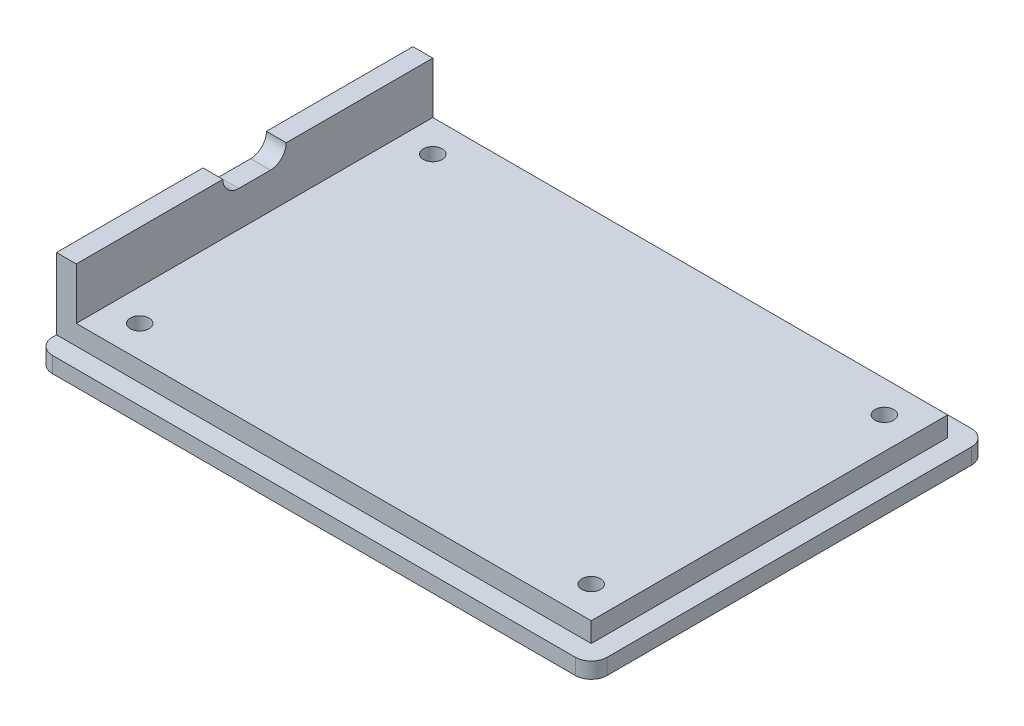
ISO-10303-21;
HEADER;
FILE_DESCRIPTION(('STEP AP214'),'2;1');
FILE_NAME('part.step','',(''),(''),'','','');
FILE_SCHEMA(('AUTOMOTIVE_DESIGN { 1 0 10303 214 1 1 1 1 }'));
ENDSEC;
DATA;
#1=APPLICATION_CONTEXT('core data for automotive mechanical design processes');
#2=APPLICATION_PROTOCOL_DEFINITION('international standard','automotive_design',2000,#1);
#3=PRODUCT_CONTEXT('',#1,'mechanical');
#4=PRODUCT('Part','Part','',(#3));
#5=PRODUCT_RELATED_PRODUCT_CATEGORY('part','',(#4));
#6=PRODUCT_DEFINITION_FORMATION('','',#4);
#7=PRODUCT_DEFINITION_CONTEXT('part definition',#1,'design');
#8=PRODUCT_DEFINITION('design','',#6,#7);
#9=PRODUCT_DEFINITION_SHAPE('','',#8);
#10=(LENGTH_UNIT() NAMED_UNIT(*) SI_UNIT(.MILLI.,.METRE.));
#11=(NAMED_UNIT(*) PLANE_ANGLE_UNIT() SI_UNIT($,.RADIAN.));
#12=(NAMED_UNIT(*) SI_UNIT($,.STERADIAN.) SOLID_ANGLE_UNIT());
#13=UNCERTAINTY_MEASURE_WITH_UNIT(LENGTH_MEASURE(1.E-05),#10,'distance_accuracy_value','');
#14=(GEOMETRIC_REPRESENTATION_CONTEXT(3) GLOBAL_UNCERTAINTY_ASSIGNED_CONTEXT((#13)) GLOBAL_UNIT_ASSIGNED_CONTEXT((#10,
#11,#12)) REPRESENTATION_CONTEXT('',''));
#15=CARTESIAN_POINT('',(0.,0.,0.));
#16=DIRECTION('',(0.,0.,1.));
#17=DIRECTION('',(1.,0.,0.));
#18=AXIS2_PLACEMENT_3D('',#15,#16,#17);
#19=CARTESIAN_POINT('',(-36.195,-7.493,-23.495));
#20=DIRECTION('',(0.,1.,0.));
#21=DIRECTION('',(0.,0.,1.));
#22=AXIS2_PLACEMENT_3D('',#19,#20,#21);
#23=CYLINDRICAL_SURFACE('',#22,1.5);
#24=CARTESIAN_POINT('',(-36.195,5.715,-23.495));
#25=DIRECTION('',(0.,1.,0.));
#26=DIRECTION('',(0.,0.,1.));
#27=AXIS2_PLACEMENT_3D('',#24,#25,#26);
#28=CIRCLE('',#27,1.5);
#29=CARTESIAN_POINT('',(-36.195,5.715,-21.995));
#30=VERTEX_POINT('',#29);
#31=EDGE_CURVE('E199',#30,#30,#28,.T.);
#32=ORIENTED_EDGE('',*,*,#31,.T.);
#33=EDGE_LOOP('',(#32));
#34=FACE_BOUND('',#33,.T.);
#35=CARTESIAN_POINT('',(-36.195,3.175,-23.495));
#36=DIRECTION('',(0.,-1.,0.));
#37=DIRECTION('',(0.,0.,-1.));
#38=AXIS2_PLACEMENT_3D('',#35,#36,#37);
#39=CIRCLE('',#38,1.5);
#40=CARTESIAN_POINT('',(-36.195,3.175,-24.995));
#41=VERTEX_POINT('',#40);
#42=EDGE_CURVE('E39',#41,#41,#39,.F.);
#43=ORIENTED_EDGE('',*,*,#42,.F.);
#44=EDGE_LOOP('',(#43));
#45=FACE_BOUND('',#44,.T.);
#46=ADVANCED_FACE('F35',(#34,#45),#23,.F.);
#47=CARTESIAN_POINT('',(36.195,-7.493,-23.495));
#48=DIRECTION('',(0.,1.,0.));
#49=DIRECTION('',(0.,0.,1.));
#50=AXIS2_PLACEMENT_3D('',#47,#48,#49);
#51=CYLINDRICAL_SURFACE('',#50,1.5);
#52=CARTESIAN_POINT('',(36.195,5.715,-23.495));
#53=DIRECTION('',(0.,1.,0.));
#54=DIRECTION('',(0.,0.,1.));
#55=AXIS2_PLACEMENT_3D('',#52,#53,#54);
#56=CIRCLE('',#55,1.5);
#57=CARTESIAN_POINT('',(36.195,5.715,-21.995));
#58=VERTEX_POINT('',#57);
#59=EDGE_CURVE('E314',#58,#58,#56,.T.);
#60=ORIENTED_EDGE('',*,*,#59,.T.);
#61=EDGE_LOOP('',(#60));
#62=FACE_BOUND('',#61,.T.);
#63=CARTESIAN_POINT('',(36.195,3.175,-23.495));
#64=DIRECTION('',(0.,-1.,0.));
#65=DIRECTION('',(0.,0.,-1.));
#66=AXIS2_PLACEMENT_3D('',#63,#64,#65);
#67=CIRCLE('',#66,1.5);
#68=CARTESIAN_POINT('',(36.195,3.175,-24.995));
#69=VERTEX_POINT('',#68);
#70=EDGE_CURVE('E300',#69,#69,#67,.F.);
#71=ORIENTED_EDGE('',*,*,#70,.F.);
#72=EDGE_LOOP('',(#71));
#73=FACE_BOUND('',#72,.T.);
#74=ADVANCED_FACE('F368',(#62,#73),#51,.F.);
#75=CARTESIAN_POINT('',(36.195,-7.493,23.495));
#76=DIRECTION('',(0.,1.,0.));
#77=DIRECTION('',(0.,0.,1.));
#78=AXIS2_PLACEMENT_3D('',#75,#76,#77);
#79=CYLINDRICAL_SURFACE('',#78,1.5);
#80=CARTESIAN_POINT('',(36.195,5.715,23.495));
#81=DIRECTION('',(0.,1.,0.));
#82=DIRECTION('',(0.,0.,-1.));
#83=AXIS2_PLACEMENT_3D('',#80,#81,#82);
#84=CIRCLE('',#83,1.5);
#85=CARTESIAN_POINT('',(36.195,5.715,21.995));
#86=VERTEX_POINT('',#85);
#87=EDGE_CURVE('E309',#86,#86,#84,.T.);
#88=ORIENTED_EDGE('',*,*,#87,.T.);
#89=EDGE_LOOP('',(#88));
#90=FACE_BOUND('',#89,.T.);
#91=CARTESIAN_POINT('',(36.195,3.175,23.495));
#92=DIRECTION('',(0.,-1.,0.));
#93=DIRECTION('',(0.,0.,-1.));
#94=AXIS2_PLACEMENT_3D('',#91,#92,#93);
#95=CIRCLE('',#94,1.5);
#96=CARTESIAN_POINT('',(36.195,3.175,21.995));
#97=VERTEX_POINT('',#96);
#98=EDGE_CURVE('E297',#97,#97,#95,.F.);
#99=ORIENTED_EDGE('',*,*,#98,.F.);
#100=EDGE_LOOP('',(#99));
#101=FACE_BOUND('',#100,.T.);
#102=ADVANCED_FACE('F374',(#90,#101),#79,.F.);
#103=CARTESIAN_POINT('',(-36.195,-7.493,23.495));
#104=DIRECTION('',(0.,1.,0.));
#105=DIRECTION('',(0.,0.,1.));
#106=AXIS2_PLACEMENT_3D('',#103,#104,#105);
#107=CYLINDRICAL_SURFACE('',#106,1.5);
#108=CARTESIAN_POINT('',(-36.195,5.715,23.495));
#109=DIRECTION('',(0.,1.,0.));
#110=DIRECTION('',(0.,0.,-1.));
#111=AXIS2_PLACEMENT_3D('',#108,#109,#110);
#112=CIRCLE('',#111,1.5);
#113=CARTESIAN_POINT('',(-36.195,5.715,21.995));
#114=VERTEX_POINT('',#113);
#115=EDGE_CURVE('E305',#114,#114,#112,.T.);
#116=ORIENTED_EDGE('',*,*,#115,.T.);
#117=EDGE_LOOP('',(#116));
#118=FACE_BOUND('',#117,.T.);
#119=CARTESIAN_POINT('',(-36.195,3.175,23.495));
#120=DIRECTION('',(0.,-1.,0.));
#121=DIRECTION('',(0.,0.,-1.));
#122=AXIS2_PLACEMENT_3D('',#119,#120,#121);
#123=CIRCLE('',#122,1.5);
#124=CARTESIAN_POINT('',(-36.195,3.175,21.995));
#125=VERTEX_POINT('',#124);
#126=EDGE_CURVE('E294',#125,#125,#123,.F.);
#127=ORIENTED_EDGE('',*,*,#126,.F.);
#128=EDGE_LOOP('',(#127));
#129=FACE_BOUND('',#128,.T.);
#130=ADVANCED_FACE('F379',(#118,#129),#107,.F.);
#131=CARTESIAN_POINT('',(-41.275,5.715,-28.575));
#132=DIRECTION('',(0.,0.,-1.));
#133=DIRECTION('',(-1.,0.,0.));
#134=AXIS2_PLACEMENT_3D('',#131,#132,#133);
#135=PLANE('',#134);
#136=DIRECTION('',(0.,-1.,0.));
#137=VECTOR('',#136,1.);
#138=CARTESIAN_POINT('',(41.275,5.715,-28.575));
#139=LINE('',#138,#137);
#140=CARTESIAN_POINT('',(41.275,5.715,-28.575));
#141=VERTEX_POINT('',#140);
#142=CARTESIAN_POINT('',(41.275,2.54,-28.575));
#143=VERTEX_POINT('',#142);
#144=EDGE_CURVE('E246',#141,#143,#139,.T.);
#145=ORIENTED_EDGE('',*,*,#144,.T.);
#146=DIRECTION('',(-1.,0.,0.));
#147=VECTOR('',#146,1.);
#148=CARTESIAN_POINT('',(-41.275,2.54,-28.575));
#149=LINE('',#148,#147);
#150=CARTESIAN_POINT('',(-44.45,2.54,-28.575));
#151=VERTEX_POINT('',#150);
#152=EDGE_CURVE('E175',#143,#151,#149,.T.);
#153=ORIENTED_EDGE('',*,*,#152,.T.);
#154=DIRECTION('',(0.,-1.,0.));
#155=VECTOR('',#154,1.);
#156=CARTESIAN_POINT('',(-44.45,13.97,-28.575));
#157=LINE('',#156,#155);
#158=CARTESIAN_POINT('',(-44.45,13.97,-28.575));
#159=VERTEX_POINT('',#158);
#160=EDGE_CURVE('E194',#159,#151,#157,.T.);
#161=ORIENTED_EDGE('',*,*,#160,.F.);
#162=DIRECTION('',(-1.,0.,0.));
#163=VECTOR('',#162,1.);
#164=CARTESIAN_POINT('',(17.0067930403655,13.97,-28.575));
#165=LINE('',#164,#163);
#166=CARTESIAN_POINT('',(-41.275,13.97,-28.575));
#167=VERTEX_POINT('',#166);
#168=EDGE_CURVE('E208',#167,#159,#165,.T.);
#169=ORIENTED_EDGE('',*,*,#168,.F.);
#170=DIRECTION('',(0.,1.,0.));
#171=VECTOR('',#170,1.);
#172=CARTESIAN_POINT('',(-41.275,13.97,-28.575));
#173=LINE('',#172,#171);
#174=CARTESIAN_POINT('',(-41.275,5.715,-28.575));
#175=VERTEX_POINT('',#174);
#176=EDGE_CURVE('E219',#175,#167,#173,.T.);
#177=ORIENTED_EDGE('',*,*,#176,.F.);
#178=DIRECTION('',(1.,0.,0.));
#179=VECTOR('',#178,1.);
#180=CARTESIAN_POINT('',(-41.275,5.715,-28.575));
#181=LINE('',#180,#179);
#182=EDGE_CURVE('E228',#175,#141,#181,.T.);
#183=ORIENTED_EDGE('',*,*,#182,.T.);
#184=EDGE_LOOP('',(#145,#153,#161,#169,#177,#183));
#185=FACE_BOUND('',#184,.T.);
#186=ADVANCED_FACE('F341',(#185),#135,.T.);
#187=CARTESIAN_POINT('',(-41.275,5.715,28.575));
#188=DIRECTION('',(0.,0.,-1.));
#189=DIRECTION('',(-1.,0.,0.));
#190=AXIS2_PLACEMENT_3D('',#187,#188,#189);
#191=PLANE('',#190);
#192=DIRECTION('',(1.,0.,0.));
#193=VECTOR('',#192,1.);
#194=CARTESIAN_POINT('',(-41.275,2.54,28.575));
#195=LINE('',#194,#193);
#196=CARTESIAN_POINT('',(-44.45,2.54,28.575));
#197=VERTEX_POINT('',#196);
#198=CARTESIAN_POINT('',(41.275,2.54,28.575));
#199=VERTEX_POINT('',#198);
#200=EDGE_CURVE('E163',#197,#199,#195,.T.);
#201=ORIENTED_EDGE('',*,*,#200,.T.);
#202=DIRECTION('',(0.,-1.,0.));
#203=VECTOR('',#202,1.);
#204=CARTESIAN_POINT('',(41.275,5.715,28.575));
#205=LINE('',#204,#203);
#206=CARTESIAN_POINT('',(41.275,5.715,28.575));
#207=VERTEX_POINT('',#206);
#208=EDGE_CURVE('E247',#207,#199,#205,.T.);
#209=ORIENTED_EDGE('',*,*,#208,.F.);
#210=DIRECTION('',(1.,0.,0.));
#211=VECTOR('',#210,1.);
#212=CARTESIAN_POINT('',(-41.275,5.715,28.575));
#213=LINE('',#212,#211);
#214=CARTESIAN_POINT('',(-41.275,5.715,28.575));
#215=VERTEX_POINT('',#214);
#216=EDGE_CURVE('E241',#215,#207,#213,.T.);
#217=ORIENTED_EDGE('',*,*,#216,.F.);
#218=DIRECTION('',(0.,-1.,0.));
#219=VECTOR('',#218,1.);
#220=CARTESIAN_POINT('',(-41.275,2.54,28.575));
#221=LINE('',#220,#219);
#222=CARTESIAN_POINT('',(-41.275,13.97,28.575));
#223=VERTEX_POINT('',#222);
#224=EDGE_CURVE('E210',#223,#215,#221,.T.);
#225=ORIENTED_EDGE('',*,*,#224,.F.);
#226=DIRECTION('',(-1.,0.,0.));
#227=VECTOR('',#226,1.);
#228=CARTESIAN_POINT('',(17.0067930403655,13.97,28.575));
#229=LINE('',#228,#227);
#230=CARTESIAN_POINT('',(-44.45,13.97,28.575));
#231=VERTEX_POINT('',#230);
#232=EDGE_CURVE('E191',#223,#231,#229,.T.);
#233=ORIENTED_EDGE('',*,*,#232,.T.);
#234=DIRECTION('',(0.,1.,0.));
#235=VECTOR('',#234,1.);
#236=CARTESIAN_POINT('',(-44.45,2.54,28.575));
#237=LINE('',#236,#235);
#238=EDGE_CURVE('E182',#197,#231,#237,.T.);
#239=ORIENTED_EDGE('',*,*,#238,.F.);
#240=EDGE_LOOP('',(#201,#209,#217,#225,#233,#239));
#241=FACE_BOUND('',#240,.T.);
#242=ADVANCED_FACE('F188',(#241),#191,.F.);
#243=CARTESIAN_POINT('',(41.275,5.715,28.575));
#244=DIRECTION('',(-1.,0.,0.));
#245=DIRECTION('',(0.,0.,1.));
#246=AXIS2_PLACEMENT_3D('',#243,#244,#245);
#247=PLANE('',#246);
#248=DIRECTION('',(0.,0.,-1.));
#249=VECTOR('',#248,1.);
#250=CARTESIAN_POINT('',(41.275,2.54,28.575));
#251=LINE('',#250,#249);
#252=EDGE_CURVE('E170',#199,#143,#251,.T.);
#253=ORIENTED_EDGE('',*,*,#252,.T.);
#254=ORIENTED_EDGE('',*,*,#144,.F.);
#255=DIRECTION('',(0.,0.,-1.));
#256=VECTOR('',#255,1.);
#257=CARTESIAN_POINT('',(41.275,5.715,28.575));
#258=LINE('',#257,#256);
#259=EDGE_CURVE('E239',#207,#141,#258,.T.);
#260=ORIENTED_EDGE('',*,*,#259,.F.);
#261=ORIENTED_EDGE('',*,*,#208,.T.);
#262=EDGE_LOOP('',(#253,#254,#260,#261));
#263=FACE_BOUND('',#262,.T.);
#264=ADVANCED_FACE('F403',(#263),#247,.F.);
#265=CARTESIAN_POINT('',(0.,5.715,0.));
#266=DIRECTION('',(0.,1.,0.));
#267=DIRECTION('',(0.,0.,1.));
#268=AXIS2_PLACEMENT_3D('',#265,#266,#267);
#269=PLANE('',#268);
#270=ORIENTED_EDGE('',*,*,#115,.F.);
#271=EDGE_LOOP('',(#270));
#272=FACE_BOUND('',#271,.T.);
#273=ORIENTED_EDGE('',*,*,#87,.F.);
#274=EDGE_LOOP('',(#273));
#275=FACE_BOUND('',#274,.T.);
#276=ORIENTED_EDGE('',*,*,#59,.F.);
#277=EDGE_LOOP('',(#276));
#278=FACE_BOUND('',#277,.T.);
#279=ORIENTED_EDGE('',*,*,#31,.F.);
#280=EDGE_LOOP('',(#279));
#281=FACE_BOUND('',#280,.T.);
#282=ORIENTED_EDGE('',*,*,#182,.F.);
#283=DIRECTION('',(0.,0.,-1.));
#284=VECTOR('',#283,1.);
#285=CARTESIAN_POINT('',(-41.275,5.715,28.575));
#286=LINE('',#285,#284);
#287=EDGE_CURVE('E243',#215,#175,#286,.T.);
#288=ORIENTED_EDGE('',*,*,#287,.F.);
#289=ORIENTED_EDGE('',*,*,#216,.T.);
#290=ORIENTED_EDGE('',*,*,#259,.T.);
#291=EDGE_LOOP('',(#282,#288,#289,#290));
#292=FACE_BOUND('',#291,.T.);
#293=ADVANCED_FACE('F399',(#272,#275,#278,#281,#292),#269,.T.);
#294=CARTESIAN_POINT('',(0.,2.54,0.));
#295=DIRECTION('',(0.,-1.,0.));
#296=DIRECTION('',(0.,0.,-1.));
#297=AXIS2_PLACEMENT_3D('',#294,#295,#296);
#298=PLANE('',#297);
#299=DIRECTION('',(1.,0.,0.));
#300=VECTOR('',#299,1.);
#301=CARTESIAN_POINT('',(-44.45,2.54,31.75));
#302=LINE('',#301,#300);
#303=CARTESIAN_POINT('',(-41.91,2.54,31.75));
#304=VERTEX_POINT('',#303);
#305=CARTESIAN_POINT('',(41.91,2.54,31.75));
#306=VERTEX_POINT('',#305);
#307=EDGE_CURVE('E222',#304,#306,#302,.T.);
#308=ORIENTED_EDGE('',*,*,#307,.T.);
#309=CARTESIAN_POINT('',(41.91,2.54,29.21));
#310=DIRECTION('',(0.,-1.,0.));
#311=DIRECTION('',(0.,0.,-1.));
#312=AXIS2_PLACEMENT_3D('',#309,#310,#311);
#313=CIRCLE('',#312,2.54);
#314=CARTESIAN_POINT('',(44.45,2.54,29.21));
#315=VERTEX_POINT('',#314);
#316=EDGE_CURVE('E279',#306,#315,#313,.F.);
#317=ORIENTED_EDGE('',*,*,#316,.T.);
#318=DIRECTION('',(0.,0.,-1.));
#319=VECTOR('',#318,1.);
#320=CARTESIAN_POINT('',(44.45,2.54,31.75));
#321=LINE('',#320,#319);
#322=CARTESIAN_POINT('',(44.45,2.54,-29.21));
#323=VERTEX_POINT('',#322);
#324=EDGE_CURVE('E224',#315,#323,#321,.T.);
#325=ORIENTED_EDGE('',*,*,#324,.T.);
#326=CARTESIAN_POINT('',(41.91,2.54,-29.21));
#327=DIRECTION('',(0.,-1.,0.));
#328=DIRECTION('',(0.,0.,-1.));
#329=AXIS2_PLACEMENT_3D('',#326,#327,#328);
#330=CIRCLE('',#329,2.54);
#331=CARTESIAN_POINT('',(41.91,2.54,-31.75));
#332=VERTEX_POINT('',#331);
#333=EDGE_CURVE('E59',#323,#332,#330,.F.);
#334=ORIENTED_EDGE('',*,*,#333,.T.);
#335=DIRECTION('',(-1.,0.,0.));
#336=VECTOR('',#335,1.);
#337=CARTESIAN_POINT('',(-44.45,2.54,-31.75));
#338=LINE('',#337,#336);
#339=CARTESIAN_POINT('',(-41.91,2.54,-31.75));
#340=VERTEX_POINT('',#339);
#341=EDGE_CURVE('E226',#332,#340,#338,.T.);
#342=ORIENTED_EDGE('',*,*,#341,.T.);
#343=CARTESIAN_POINT('',(-41.91,2.54,-29.21));
#344=DIRECTION('',(0.,-1.,0.));
#345=DIRECTION('',(0.,0.,-1.));
#346=AXIS2_PLACEMENT_3D('',#343,#344,#345);
#347=CIRCLE('',#346,2.54);
#348=CARTESIAN_POINT('',(-44.45,2.54,-29.21));
#349=VERTEX_POINT('',#348);
#350=EDGE_CURVE('E274',#340,#349,#347,.F.);
#351=ORIENTED_EDGE('',*,*,#350,.T.);
#352=DIRECTION('',(0.,0.,1.));
#353=VECTOR('',#352,1.);
#354=CARTESIAN_POINT('',(-44.45,2.54,31.75));
#355=LINE('',#354,#353);
#356=EDGE_CURVE('E185',#349,#151,#355,.T.);
#357=ORIENTED_EDGE('',*,*,#356,.T.);
#358=ORIENTED_EDGE('',*,*,#152,.F.);
#359=ORIENTED_EDGE('',*,*,#252,.F.);
#360=ORIENTED_EDGE('',*,*,#200,.F.);
#361=CARTESIAN_POINT('',(-44.45,2.54,29.21));
#362=VERTEX_POINT('',#361);
#363=EDGE_CURVE('E167',#197,#362,#355,.T.);
#364=ORIENTED_EDGE('',*,*,#363,.T.);
#365=CARTESIAN_POINT('',(-41.91,2.54,29.21));
#366=DIRECTION('',(0.,-1.,0.));
#367=DIRECTION('',(0.,0.,-1.));
#368=AXIS2_PLACEMENT_3D('',#365,#366,#367);
#369=CIRCLE('',#368,2.54);
#370=EDGE_CURVE('E276',#362,#304,#369,.F.);
#371=ORIENTED_EDGE('',*,*,#370,.T.);
#372=EDGE_LOOP('',(#308,#317,#325,#334,#342,#351,#357,#358,#359,#360,#364,#371));
#373=FACE_BOUND('',#372,.T.);
#374=ADVANCED_FACE('F166',(#373),#298,.F.);
#375=CARTESIAN_POINT('',(-44.45,2.54,31.75));
#376=DIRECTION('',(1.,0.,0.));
#377=DIRECTION('',(0.,0.,-1.));
#378=AXIS2_PLACEMENT_3D('',#375,#376,#377);
#379=PLANE('',#378);
#380=DIRECTION('',(0.,0.,1.));
#381=VECTOR('',#380,1.);
#382=CARTESIAN_POINT('',(-44.45,0.,31.75));
#383=LINE('',#382,#381);
#384=CARTESIAN_POINT('',(-44.45,0.,-29.21));
#385=VERTEX_POINT('',#384);
#386=CARTESIAN_POINT('',(-44.45,0.,29.21));
#387=VERTEX_POINT('',#386);
#388=EDGE_CURVE('E174',#385,#387,#383,.T.);
#389=ORIENTED_EDGE('',*,*,#388,.T.);
#390=DIRECTION('',(0.,-1.,0.));
#391=VECTOR('',#390,1.);
#392=CARTESIAN_POINT('',(-44.45,2.54,29.21));
#393=LINE('',#392,#391);
#394=EDGE_CURVE('E184',#387,#362,#393,.F.);
#395=ORIENTED_EDGE('',*,*,#394,.T.);
#396=ORIENTED_EDGE('',*,*,#363,.F.);
#397=ORIENTED_EDGE('',*,*,#238,.T.);
#398=DIRECTION('',(0.,0.,-1.));
#399=VECTOR('',#398,1.);
#400=CARTESIAN_POINT('',(-44.45,13.97,28.575));
#401=LINE('',#400,#399);
#402=CARTESIAN_POINT('',(-44.45,13.9699999999999,5.08));
#403=VERTEX_POINT('',#402);
#404=EDGE_CURVE('E193',#231,#403,#401,.T.);
#405=ORIENTED_EDGE('',*,*,#404,.T.);
#406=CARTESIAN_POINT('',(-44.45,13.9699999999999,2.54));
#407=DIRECTION('',(1.,0.,0.));
#408=DIRECTION('',(0.,0.,-1.));
#409=AXIS2_PLACEMENT_3D('',#406,#407,#408);
#410=CIRCLE('',#409,2.54);
#411=CARTESIAN_POINT('',(-44.45,11.4299999999999,2.54));
#412=VERTEX_POINT('',#411);
#413=EDGE_CURVE('E44',#403,#412,#410,.T.);
#414=ORIENTED_EDGE('',*,*,#413,.T.);
#415=DIRECTION('',(0.,0.,-1.));
#416=VECTOR('',#415,1.);
#417=CARTESIAN_POINT('',(-44.45,11.4299999999999,5.08));
#418=LINE('',#417,#416);
#419=CARTESIAN_POINT('',(-44.45,11.4299999999999,-2.54));
#420=VERTEX_POINT('',#419);
#421=EDGE_CURVE('E196',#412,#420,#418,.T.);
#422=ORIENTED_EDGE('',*,*,#421,.T.);
#423=CARTESIAN_POINT('',(-44.45,13.9699999999999,-2.54));
#424=DIRECTION('',(1.,0.,0.));
#425=DIRECTION('',(0.,0.,-1.));
#426=AXIS2_PLACEMENT_3D('',#423,#424,#425);
#427=CIRCLE('',#426,2.54);
#428=CARTESIAN_POINT('',(-44.45,13.9699999999999,-5.08));
#429=VERTEX_POINT('',#428);
#430=EDGE_CURVE('E289',#420,#429,#427,.T.);
#431=ORIENTED_EDGE('',*,*,#430,.T.);
#432=DIRECTION('',(0.,0.,-1.));
#433=VECTOR('',#432,1.);
#434=CARTESIAN_POINT('',(-44.45,13.9699999999999,-5.08));
#435=LINE('',#434,#433);
#436=EDGE_CURVE('E205',#429,#159,#435,.T.);
#437=ORIENTED_EDGE('',*,*,#436,.T.);
#438=ORIENTED_EDGE('',*,*,#160,.T.);
#439=ORIENTED_EDGE('',*,*,#356,.F.);
#440=DIRECTION('',(0.,-1.,0.));
#441=VECTOR('',#440,1.);
#442=CARTESIAN_POINT('',(-44.45,2.54,-29.21));
#443=LINE('',#442,#441);
#444=EDGE_CURVE('E285',#349,#385,#443,.T.);
#445=ORIENTED_EDGE('',*,*,#444,.T.);
#446=EDGE_LOOP('',(#389,#395,#396,#397,#405,#414,#422,#431,#437,#438,#439,#445));
#447=FACE_BOUND('',#446,.T.);
#448=ADVANCED_FACE('F180',(#447),#379,.F.);
#449=CARTESIAN_POINT('',(-44.45,2.54,31.75));
#450=DIRECTION('',(0.,0.,-1.));
#451=DIRECTION('',(-1.,0.,0.));
#452=AXIS2_PLACEMENT_3D('',#449,#450,#451);
#453=PLANE('',#452);
#454=DIRECTION('',(1.,0.,0.));
#455=VECTOR('',#454,1.);
#456=CARTESIAN_POINT('',(-44.45,0.,31.75));
#457=LINE('',#456,#455);
#458=CARTESIAN_POINT('',(-41.91,0.,31.75));
#459=VERTEX_POINT('',#458);
#460=CARTESIAN_POINT('',(41.91,0.,31.75));
#461=VERTEX_POINT('',#460);
#462=EDGE_CURVE('E230',#459,#461,#457,.T.);
#463=ORIENTED_EDGE('',*,*,#462,.T.);
#464=DIRECTION('',(0.,-1.,0.));
#465=VECTOR('',#464,1.);
#466=CARTESIAN_POINT('',(41.91,2.54,31.75));
#467=LINE('',#466,#465);
#468=EDGE_CURVE('E272',#461,#306,#467,.F.);
#469=ORIENTED_EDGE('',*,*,#468,.T.);
#470=ORIENTED_EDGE('',*,*,#307,.F.);
#471=DIRECTION('',(0.,-1.,0.));
#472=VECTOR('',#471,1.);
#473=CARTESIAN_POINT('',(-41.91,2.54,31.75));
#474=LINE('',#473,#472);
#475=EDGE_CURVE('E269',#304,#459,#474,.T.);
#476=ORIENTED_EDGE('',*,*,#475,.T.);
#477=EDGE_LOOP('',(#463,#469,#470,#476));
#478=FACE_BOUND('',#477,.T.);
#479=ADVANCED_FACE('F432',(#478),#453,.F.);
#480=CARTESIAN_POINT('',(44.45,2.54,31.75));
#481=DIRECTION('',(-1.,0.,0.));
#482=DIRECTION('',(0.,0.,1.));
#483=AXIS2_PLACEMENT_3D('',#480,#481,#482);
#484=PLANE('',#483);
#485=ORIENTED_EDGE('',*,*,#324,.F.);
#486=DIRECTION('',(0.,-1.,0.));
#487=VECTOR('',#486,1.);
#488=CARTESIAN_POINT('',(44.45,2.54,29.21));
#489=LINE('',#488,#487);
#490=CARTESIAN_POINT('',(44.45,0.,29.21));
#491=VERTEX_POINT('',#490);
#492=EDGE_CURVE('E258',#315,#491,#489,.T.);
#493=ORIENTED_EDGE('',*,*,#492,.T.);
#494=DIRECTION('',(0.,0.,-1.));
#495=VECTOR('',#494,1.);
#496=CARTESIAN_POINT('',(44.45,0.,31.75));
#497=LINE('',#496,#495);
#498=CARTESIAN_POINT('',(44.45,0.,-29.21));
#499=VERTEX_POINT('',#498);
#500=EDGE_CURVE('E233',#491,#499,#497,.T.);
#501=ORIENTED_EDGE('',*,*,#500,.T.);
#502=DIRECTION('',(0.,-1.,0.));
#503=VECTOR('',#502,1.);
#504=CARTESIAN_POINT('',(44.45,2.54,-29.21));
#505=LINE('',#504,#503);
#506=EDGE_CURVE('E256',#499,#323,#505,.F.);
#507=ORIENTED_EDGE('',*,*,#506,.T.);
#508=EDGE_LOOP('',(#485,#493,#501,#507));
#509=FACE_BOUND('',#508,.T.);
#510=ADVANCED_FACE('F393',(#509),#484,.F.);
#511=CARTESIAN_POINT('',(-44.45,2.54,-31.75));
#512=DIRECTION('',(0.,0.,1.));
#513=DIRECTION('',(1.,0.,0.));
#514=AXIS2_PLACEMENT_3D('',#511,#512,#513);
#515=PLANE('',#514);
#516=ORIENTED_EDGE('',*,*,#341,.F.);
#517=DIRECTION('',(0.,-1.,0.));
#518=VECTOR('',#517,1.);
#519=CARTESIAN_POINT('',(41.91,2.54,-31.75));
#520=LINE('',#519,#518);
#521=CARTESIAN_POINT('',(41.91,0.,-31.75));
#522=VERTEX_POINT('',#521);
#523=EDGE_CURVE('E282',#332,#522,#520,.T.);
#524=ORIENTED_EDGE('',*,*,#523,.T.);
#525=DIRECTION('',(-1.,0.,0.));
#526=VECTOR('',#525,1.);
#527=CARTESIAN_POINT('',(-44.45,0.,-31.75));
#528=LINE('',#527,#526);
#529=CARTESIAN_POINT('',(-41.91,0.,-31.75));
#530=VERTEX_POINT('',#529);
#531=EDGE_CURVE('E186',#522,#530,#528,.T.);
#532=ORIENTED_EDGE('',*,*,#531,.T.);
#533=DIRECTION('',(0.,-1.,0.));
#534=VECTOR('',#533,1.);
#535=CARTESIAN_POINT('',(-41.91,2.54,-31.75));
#536=LINE('',#535,#534);
#537=EDGE_CURVE('E52',#530,#340,#536,.F.);
#538=ORIENTED_EDGE('',*,*,#537,.T.);
#539=EDGE_LOOP('',(#516,#524,#532,#538));
#540=FACE_BOUND('',#539,.T.);
#541=ADVANCED_FACE('F387',(#540),#515,.F.);
#542=CARTESIAN_POINT('',(0.,0.,0.));
#543=DIRECTION('',(0.,1.,0.));
#544=DIRECTION('',(0.,0.,1.));
#545=AXIS2_PLACEMENT_3D('',#542,#543,#544);
#546=PLANE('',#545);
#547=CARTESIAN_POINT('',(36.195,0.,23.495));
#548=DIRECTION('',(0.,-1.,0.));
#549=DIRECTION('',(0.,0.,-1.));
#550=AXIS2_PLACEMENT_3D('',#547,#548,#549);
#551=CIRCLE('',#550,3.5);
#552=CARTESIAN_POINT('',(36.195,0.,19.995));
#553=VERTEX_POINT('',#552);
#554=EDGE_CURVE('E479',#553,#553,#551,.T.);
#555=ORIENTED_EDGE('',*,*,#554,.F.);
#556=EDGE_LOOP('',(#555));
#557=FACE_BOUND('',#556,.T.);
#558=CARTESIAN_POINT('',(36.195,0.,-23.495));
#559=DIRECTION('',(0.,-1.,0.));
#560=DIRECTION('',(0.,0.,-1.));
#561=AXIS2_PLACEMENT_3D('',#558,#559,#560);
#562=CIRCLE('',#561,3.5);
#563=CARTESIAN_POINT('',(36.195,0.,-26.995));
#564=VERTEX_POINT('',#563);
#565=EDGE_CURVE('E485',#564,#564,#562,.T.);
#566=ORIENTED_EDGE('',*,*,#565,.F.);
#567=EDGE_LOOP('',(#566));
#568=FACE_BOUND('',#567,.T.);
#569=CARTESIAN_POINT('',(-36.195,0.,-23.495));
#570=DIRECTION('',(0.,-1.,0.));
#571=DIRECTION('',(0.,0.,-1.));
#572=AXIS2_PLACEMENT_3D('',#569,#570,#571);
#573=CIRCLE('',#572,3.5);
#574=CARTESIAN_POINT('',(-36.195,0.,-26.995));
#575=VERTEX_POINT('',#574);
#576=EDGE_CURVE('E491',#575,#575,#573,.T.);
#577=ORIENTED_EDGE('',*,*,#576,.F.);
#578=EDGE_LOOP('',(#577));
#579=FACE_BOUND('',#578,.T.);
#580=CARTESIAN_POINT('',(-36.195,0.,23.495));
#581=DIRECTION('',(0.,-1.,0.));
#582=DIRECTION('',(0.,0.,-1.));
#583=AXIS2_PLACEMENT_3D('',#580,#581,#582);
#584=CIRCLE('',#583,3.5);
#585=CARTESIAN_POINT('',(-36.195,0.,19.995));
#586=VERTEX_POINT('',#585);
#587=EDGE_CURVE('E473',#586,#586,#584,.T.);
#588=ORIENTED_EDGE('',*,*,#587,.F.);
#589=EDGE_LOOP('',(#588));
#590=FACE_BOUND('',#589,.T.);
#591=ORIENTED_EDGE('',*,*,#500,.F.);
#592=CARTESIAN_POINT('',(41.91,0.,29.21));
#593=DIRECTION('',(0.,1.,0.));
#594=DIRECTION('',(0.,0.,1.));
#595=AXIS2_PLACEMENT_3D('',#592,#593,#594);
#596=CIRCLE('',#595,2.54);
#597=EDGE_CURVE('E267',#491,#461,#596,.F.);
#598=ORIENTED_EDGE('',*,*,#597,.T.);
#599=ORIENTED_EDGE('',*,*,#462,.F.);
#600=CARTESIAN_POINT('',(-41.91,0.,29.21));
#601=DIRECTION('',(0.,1.,0.));
#602=DIRECTION('',(0.,0.,1.));
#603=AXIS2_PLACEMENT_3D('',#600,#601,#602);
#604=CIRCLE('',#603,2.54);
#605=EDGE_CURVE('E263',#459,#387,#604,.F.);
#606=ORIENTED_EDGE('',*,*,#605,.T.);
#607=ORIENTED_EDGE('',*,*,#388,.F.);
#608=CARTESIAN_POINT('',(-41.91,0.,-29.21));
#609=DIRECTION('',(0.,1.,0.));
#610=DIRECTION('',(0.,0.,1.));
#611=AXIS2_PLACEMENT_3D('',#608,#609,#610);
#612=CIRCLE('',#611,2.54);
#613=EDGE_CURVE('E261',#385,#530,#612,.F.);
#614=ORIENTED_EDGE('',*,*,#613,.T.);
#615=ORIENTED_EDGE('',*,*,#531,.F.);
#616=CARTESIAN_POINT('',(41.91,0.,-29.21));
#617=DIRECTION('',(0.,1.,0.));
#618=DIRECTION('',(0.,0.,1.));
#619=AXIS2_PLACEMENT_3D('',#616,#617,#618);
#620=CIRCLE('',#619,2.54);
#621=EDGE_CURVE('E265',#522,#499,#620,.F.);
#622=ORIENTED_EDGE('',*,*,#621,.T.);
#623=EDGE_LOOP('',(#591,#598,#599,#606,#607,#614,#615,#622));
#624=FACE_BOUND('',#623,.T.);
#625=ADVANCED_FACE('F383',(#557,#568,#579,#590,#624),#546,.F.);
#626=CARTESIAN_POINT('',(17.0067930403655,13.9699999999999,-5.08));
#627=DIRECTION('',(0.,1.,0.));
#628=DIRECTION('',(0.,0.,1.));
#629=AXIS2_PLACEMENT_3D('',#626,#627,#628);
#630=PLANE('',#629);
#631=DIRECTION('',(0.,0.,1.));
#632=VECTOR('',#631,1.);
#633=CARTESIAN_POINT('',(-41.275,13.9699999999999,-5.08));
#634=LINE('',#633,#632);
#635=CARTESIAN_POINT('',(-41.275,13.9699999999999,-5.08));
#636=VERTEX_POINT('',#635);
#637=EDGE_CURVE('E327',#167,#636,#634,.T.);
#638=ORIENTED_EDGE('',*,*,#637,.F.);
#639=ORIENTED_EDGE('',*,*,#168,.T.);
#640=ORIENTED_EDGE('',*,*,#436,.F.);
#641=DIRECTION('',(-1.,0.,0.));
#642=VECTOR('',#641,1.);
#643=CARTESIAN_POINT('',(17.0067930403655,13.9699999999999,-5.08));
#644=LINE('',#643,#642);
#645=EDGE_CURVE('E211',#636,#429,#644,.T.);
#646=ORIENTED_EDGE('',*,*,#645,.F.);
#647=EDGE_LOOP('',(#638,#639,#640,#646));
#648=FACE_BOUND('',#647,.T.);
#649=ADVANCED_FACE('F337',(#648),#630,.T.);
#650=CARTESIAN_POINT('',(17.0067930403655,11.4299999999999,5.08));
#651=DIRECTION('',(0.,1.,0.));
#652=DIRECTION('',(0.,0.,1.));
#653=AXIS2_PLACEMENT_3D('',#650,#651,#652);
#654=PLANE('',#653);
#655=DIRECTION('',(0.,0.,1.));
#656=VECTOR('',#655,1.);
#657=CARTESIAN_POINT('',(-41.275,11.4299999999999,5.08));
#658=LINE('',#657,#656);
#659=CARTESIAN_POINT('',(-41.275,11.4299999999999,-2.54));
#660=VERTEX_POINT('',#659);
#661=CARTESIAN_POINT('',(-41.275,11.4299999999999,2.54));
#662=VERTEX_POINT('',#661);
#663=EDGE_CURVE('E324',#660,#662,#658,.T.);
#664=ORIENTED_EDGE('',*,*,#663,.F.);
#665=DIRECTION('',(-1.,0.,0.));
#666=VECTOR('',#665,1.);
#667=CARTESIAN_POINT('',(-44.45,11.4299999999999,-2.54));
#668=LINE('',#667,#666);
#669=EDGE_CURVE('E253',#660,#420,#668,.T.);
#670=ORIENTED_EDGE('',*,*,#669,.T.);
#671=ORIENTED_EDGE('',*,*,#421,.F.);
#672=DIRECTION('',(-1.,0.,0.));
#673=VECTOR('',#672,1.);
#674=CARTESIAN_POINT('',(-41.275,11.4299999999999,2.54));
#675=LINE('',#674,#673);
#676=EDGE_CURVE('E249',#412,#662,#675,.F.);
#677=ORIENTED_EDGE('',*,*,#676,.T.);
#678=EDGE_LOOP('',(#664,#670,#671,#677));
#679=FACE_BOUND('',#678,.T.);
#680=ADVANCED_FACE('F349',(#679),#654,.T.);
#681=CARTESIAN_POINT('',(17.0067930403655,13.97,28.575));
#682=DIRECTION('',(0.,1.,0.));
#683=DIRECTION('',(0.,0.,1.));
#684=AXIS2_PLACEMENT_3D('',#681,#682,#683);
#685=PLANE('',#684);
#686=DIRECTION('',(0.,0.,1.));
#687=VECTOR('',#686,1.);
#688=CARTESIAN_POINT('',(-41.275,13.97,28.575));
#689=LINE('',#688,#687);
#690=CARTESIAN_POINT('',(-41.275,13.9699999999999,5.08));
#691=VERTEX_POINT('',#690);
#692=EDGE_CURVE('E322',#691,#223,#689,.T.);
#693=ORIENTED_EDGE('',*,*,#692,.F.);
#694=DIRECTION('',(-1.,0.,0.));
#695=VECTOR('',#694,1.);
#696=CARTESIAN_POINT('',(17.0067930403655,13.9699999999999,5.08));
#697=LINE('',#696,#695);
#698=EDGE_CURVE('E214',#691,#403,#697,.T.);
#699=ORIENTED_EDGE('',*,*,#698,.T.);
#700=ORIENTED_EDGE('',*,*,#404,.F.);
#701=ORIENTED_EDGE('',*,*,#232,.F.);
#702=EDGE_LOOP('',(#693,#699,#700,#701));
#703=FACE_BOUND('',#702,.T.);
#704=ADVANCED_FACE('F357',(#703),#685,.T.);
#705=CARTESIAN_POINT('',(-41.275,5.715,28.575));
#706=DIRECTION('',(-1.,0.,0.));
#707=DIRECTION('',(0.,0.,1.));
#708=AXIS2_PLACEMENT_3D('',#705,#706,#707);
#709=PLANE('',#708);
#710=ORIENTED_EDGE('',*,*,#287,.T.);
#711=ORIENTED_EDGE('',*,*,#176,.T.);
#712=ORIENTED_EDGE('',*,*,#637,.T.);
#713=CARTESIAN_POINT('',(-41.275,13.9699999999999,-2.54));
#714=DIRECTION('',(-1.,0.,0.));
#715=DIRECTION('',(0.,0.,1.));
#716=AXIS2_PLACEMENT_3D('',#713,#714,#715);
#717=CIRCLE('',#716,2.54);
#718=EDGE_CURVE('E291',#636,#660,#717,.T.);
#719=ORIENTED_EDGE('',*,*,#718,.T.);
#720=ORIENTED_EDGE('',*,*,#663,.T.);
#721=CARTESIAN_POINT('',(-41.275,13.9699999999999,2.54));
#722=DIRECTION('',(-1.,0.,0.));
#723=DIRECTION('',(0.,0.,1.));
#724=AXIS2_PLACEMENT_3D('',#721,#722,#723);
#725=CIRCLE('',#724,2.54);
#726=EDGE_CURVE('E11',#662,#691,#725,.T.);
#727=ORIENTED_EDGE('',*,*,#726,.T.);
#728=ORIENTED_EDGE('',*,*,#692,.T.);
#729=ORIENTED_EDGE('',*,*,#224,.T.);
#730=EDGE_LOOP('',(#710,#711,#712,#719,#720,#727,#728,#729));
#731=FACE_BOUND('',#730,.T.);
#732=ADVANCED_FACE('F331',(#731),#709,.F.);
#733=CARTESIAN_POINT('',(17.0067930403655,13.9699999999999,-2.54));
#734=DIRECTION('',(1.,0.,0.));
#735=DIRECTION('',(0.,0.,-1.));
#736=AXIS2_PLACEMENT_3D('',#733,#734,#735);
#737=CYLINDRICAL_SURFACE('',#736,2.54);
#738=ORIENTED_EDGE('',*,*,#718,.F.);
#739=ORIENTED_EDGE('',*,*,#645,.T.);
#740=ORIENTED_EDGE('',*,*,#430,.F.);
#741=ORIENTED_EDGE('',*,*,#669,.F.);
#742=EDGE_LOOP('',(#738,#739,#740,#741));
#743=FACE_BOUND('',#742,.T.);
#744=ADVANCED_FACE('F344',(#743),#737,.F.);
#745=CARTESIAN_POINT('',(17.0067930403655,13.9699999999999,2.54));
#746=DIRECTION('',(1.,0.,0.));
#747=DIRECTION('',(0.,0.,-1.));
#748=AXIS2_PLACEMENT_3D('',#745,#746,#747);
#749=CYLINDRICAL_SURFACE('',#748,2.54);
#750=ORIENTED_EDGE('',*,*,#726,.F.);
#751=ORIENTED_EDGE('',*,*,#676,.F.);
#752=ORIENTED_EDGE('',*,*,#413,.F.);
#753=ORIENTED_EDGE('',*,*,#698,.F.);
#754=EDGE_LOOP('',(#750,#751,#752,#753));
#755=FACE_BOUND('',#754,.T.);
#756=ADVANCED_FACE('F353',(#755),#749,.F.);
#757=CARTESIAN_POINT('',(41.91,2.54,29.21));
#758=DIRECTION('',(0.,-1.,0.));
#759=DIRECTION('',(0.,0.,-1.));
#760=AXIS2_PLACEMENT_3D('',#757,#758,#759);
#761=CYLINDRICAL_SURFACE('',#760,2.54);
#762=ORIENTED_EDGE('',*,*,#316,.F.);
#763=ORIENTED_EDGE('',*,*,#468,.F.);
#764=ORIENTED_EDGE('',*,*,#597,.F.);
#765=ORIENTED_EDGE('',*,*,#492,.F.);
#766=EDGE_LOOP('',(#762,#763,#764,#765));
#767=FACE_BOUND('',#766,.T.);
#768=ADVANCED_FACE('F413',(#767),#761,.T.);
#769=CARTESIAN_POINT('',(41.91,2.54,-29.21));
#770=DIRECTION('',(0.,-1.,0.));
#771=DIRECTION('',(0.,0.,-1.));
#772=AXIS2_PLACEMENT_3D('',#769,#770,#771);
#773=CYLINDRICAL_SURFACE('',#772,2.54);
#774=ORIENTED_EDGE('',*,*,#333,.F.);
#775=ORIENTED_EDGE('',*,*,#506,.F.);
#776=ORIENTED_EDGE('',*,*,#621,.F.);
#777=ORIENTED_EDGE('',*,*,#523,.F.);
#778=EDGE_LOOP('',(#774,#775,#776,#777));
#779=FACE_BOUND('',#778,.T.);
#780=ADVANCED_FACE('F416',(#779),#773,.T.);
#781=CARTESIAN_POINT('',(-41.91,2.54,29.21));
#782=DIRECTION('',(0.,-1.,0.));
#783=DIRECTION('',(0.,0.,-1.));
#784=AXIS2_PLACEMENT_3D('',#781,#782,#783);
#785=CYLINDRICAL_SURFACE('',#784,2.54);
#786=ORIENTED_EDGE('',*,*,#370,.F.);
#787=ORIENTED_EDGE('',*,*,#394,.F.);
#788=ORIENTED_EDGE('',*,*,#605,.F.);
#789=ORIENTED_EDGE('',*,*,#475,.F.);
#790=EDGE_LOOP('',(#786,#787,#788,#789));
#791=FACE_BOUND('',#790,.T.);
#792=ADVANCED_FACE('F419',(#791),#785,.T.);
#793=CARTESIAN_POINT('',(-41.91,2.54,-29.21));
#794=DIRECTION('',(0.,-1.,0.));
#795=DIRECTION('',(0.,0.,-1.));
#796=AXIS2_PLACEMENT_3D('',#793,#794,#795);
#797=CYLINDRICAL_SURFACE('',#796,2.54);
#798=ORIENTED_EDGE('',*,*,#350,.F.);
#799=ORIENTED_EDGE('',*,*,#537,.F.);
#800=ORIENTED_EDGE('',*,*,#613,.F.);
#801=ORIENTED_EDGE('',*,*,#444,.F.);
#802=EDGE_LOOP('',(#798,#799,#800,#801));
#803=FACE_BOUND('',#802,.T.);
#804=ADVANCED_FACE('F37',(#803),#797,.T.);
#805=CARTESIAN_POINT('',(-36.195,3.175,23.495));
#806=DIRECTION('',(0.,-1.,0.));
#807=DIRECTION('',(0.,0.,-1.));
#808=AXIS2_PLACEMENT_3D('',#805,#806,#807);
#809=PLANE('',#808);
#810=CARTESIAN_POINT('',(-36.195,3.175,23.495));
#811=DIRECTION('',(0.,-1.,0.));
#812=DIRECTION('',(0.,0.,-1.));
#813=AXIS2_PLACEMENT_3D('',#810,#811,#812);
#814=CIRCLE('',#813,3.5);
#815=CARTESIAN_POINT('',(-36.195,3.175,19.995));
#816=VERTEX_POINT('',#815);
#817=EDGE_CURVE('E298',#816,#816,#814,.T.);
#818=ORIENTED_EDGE('',*,*,#817,.T.);
#819=EDGE_LOOP('',(#818));
#820=FACE_BOUND('',#819,.T.);
#821=ORIENTED_EDGE('',*,*,#126,.T.);
#822=EDGE_LOOP('',(#821));
#823=FACE_BOUND('',#822,.T.);
#824=ADVANCED_FACE('F426',(#820,#823),#809,.T.);
#825=CARTESIAN_POINT('',(-36.195,3.175,23.495));
#826=DIRECTION('',(0.,-1.,0.));
#827=DIRECTION('',(0.,0.,-1.));
#828=AXIS2_PLACEMENT_3D('',#825,#826,#827);
#829=CYLINDRICAL_SURFACE('',#828,3.5);
#830=ORIENTED_EDGE('',*,*,#817,.F.);
#831=EDGE_LOOP('',(#830));
#832=FACE_BOUND('',#831,.T.);
#833=ORIENTED_EDGE('',*,*,#587,.T.);
#834=EDGE_LOOP('',(#833));
#835=FACE_BOUND('',#834,.T.);
#836=ADVANCED_FACE('F508',(#832,#835),#829,.F.);
#837=CARTESIAN_POINT('',(36.195,3.175,23.495));
#838=DIRECTION('',(0.,-1.,0.));
#839=DIRECTION('',(0.,0.,-1.));
#840=AXIS2_PLACEMENT_3D('',#837,#838,#839);
#841=PLANE('',#840);
#842=CARTESIAN_POINT('',(36.195,3.175,23.495));
#843=DIRECTION('',(0.,-1.,0.));
#844=DIRECTION('',(0.,0.,-1.));
#845=AXIS2_PLACEMENT_3D('',#842,#843,#844);
#846=CIRCLE('',#845,3.5);
#847=CARTESIAN_POINT('',(36.195,3.175,19.995));
#848=VERTEX_POINT('',#847);
#849=EDGE_CURVE('E482',#848,#848,#846,.T.);
#850=ORIENTED_EDGE('',*,*,#849,.T.);
#851=EDGE_LOOP('',(#850));
#852=FACE_BOUND('',#851,.T.);
#853=ORIENTED_EDGE('',*,*,#98,.T.);
#854=EDGE_LOOP('',(#853));
#855=FACE_BOUND('',#854,.T.);
#856=ADVANCED_FACE('F510',(#852,#855),#841,.T.);
#857=CARTESIAN_POINT('',(36.195,3.175,23.495));
#858=DIRECTION('',(0.,-1.,0.));
#859=DIRECTION('',(0.,0.,-1.));
#860=AXIS2_PLACEMENT_3D('',#857,#858,#859);
#861=CYLINDRICAL_SURFACE('',#860,3.5);
#862=ORIENTED_EDGE('',*,*,#849,.F.);
#863=EDGE_LOOP('',(#862));
#864=FACE_BOUND('',#863,.T.);
#865=ORIENTED_EDGE('',*,*,#554,.T.);
#866=EDGE_LOOP('',(#865));
#867=FACE_BOUND('',#866,.T.);
#868=ADVANCED_FACE('F517',(#864,#867),#861,.F.);
#869=CARTESIAN_POINT('',(36.195,3.175,-23.495));
#870=DIRECTION('',(0.,-1.,0.));
#871=DIRECTION('',(0.,0.,-1.));
#872=AXIS2_PLACEMENT_3D('',#869,#870,#871);
#873=PLANE('',#872);
#874=CARTESIAN_POINT('',(36.195,3.175,-23.495));
#875=DIRECTION('',(0.,-1.,0.));
#876=DIRECTION('',(0.,0.,-1.));
#877=AXIS2_PLACEMENT_3D('',#874,#875,#876);
#878=CIRCLE('',#877,3.5);
#879=CARTESIAN_POINT('',(36.195,3.175,-26.995));
#880=VERTEX_POINT('',#879);
#881=EDGE_CURVE('E488',#880,#880,#878,.T.);
#882=ORIENTED_EDGE('',*,*,#881,.T.);
#883=EDGE_LOOP('',(#882));
#884=FACE_BOUND('',#883,.T.);
#885=ORIENTED_EDGE('',*,*,#70,.T.);
#886=EDGE_LOOP('',(#885));
#887=FACE_BOUND('',#886,.T.);
#888=ADVANCED_FACE('F618',(#884,#887),#873,.T.);
#889=CARTESIAN_POINT('',(36.195,3.175,-23.495));
#890=DIRECTION('',(0.,-1.,0.));
#891=DIRECTION('',(0.,0.,-1.));
#892=AXIS2_PLACEMENT_3D('',#889,#890,#891);
#893=CYLINDRICAL_SURFACE('',#892,3.5);
#894=ORIENTED_EDGE('',*,*,#881,.F.);
#895=EDGE_LOOP('',(#894));
#896=FACE_BOUND('',#895,.T.);
#897=ORIENTED_EDGE('',*,*,#565,.T.);
#898=EDGE_LOOP('',(#897));
#899=FACE_BOUND('',#898,.T.);
#900=ADVANCED_FACE('F627',(#896,#899),#893,.F.);
#901=CARTESIAN_POINT('',(-36.195,3.175,-23.495));
#902=DIRECTION('',(0.,-1.,0.));
#903=DIRECTION('',(0.,0.,-1.));
#904=AXIS2_PLACEMENT_3D('',#901,#902,#903);
#905=PLANE('',#904);
#906=CARTESIAN_POINT('',(-36.195,3.175,-23.495));
#907=DIRECTION('',(0.,-1.,0.));
#908=DIRECTION('',(0.,0.,-1.));
#909=AXIS2_PLACEMENT_3D('',#906,#907,#908);
#910=CIRCLE('',#909,3.5);
#911=CARTESIAN_POINT('',(-36.195,3.175,-26.995));
#912=VERTEX_POINT('',#911);
#913=EDGE_CURVE('E476',#912,#912,#910,.T.);
#914=ORIENTED_EDGE('',*,*,#913,.T.);
#915=EDGE_LOOP('',(#914));
#916=FACE_BOUND('',#915,.T.);
#917=ORIENTED_EDGE('',*,*,#42,.T.);
#918=EDGE_LOOP('',(#917));
#919=FACE_BOUND('',#918,.T.);
#920=ADVANCED_FACE('F497',(#916,#919),#905,.T.);
#921=CARTESIAN_POINT('',(-36.195,3.175,-23.495));
#922=DIRECTION('',(0.,-1.,0.));
#923=DIRECTION('',(0.,0.,-1.));
#924=AXIS2_PLACEMENT_3D('',#921,#922,#923);
#925=CYLINDRICAL_SURFACE('',#924,3.5);
#926=ORIENTED_EDGE('',*,*,#913,.F.);
#927=EDGE_LOOP('',(#926));
#928=FACE_BOUND('',#927,.T.);
#929=ORIENTED_EDGE('',*,*,#576,.T.);
#930=EDGE_LOOP('',(#929));
#931=FACE_BOUND('',#930,.T.);
#932=ADVANCED_FACE('F499',(#928,#931),#925,.F.);
#933=CLOSED_SHELL('',(#46,#74,#102,#130,#186,#242,#264,#293,#374,#448,#479,#510,#541,#625,#649,
#680,#704,#732,#744,#756,#768,#780,#792,#804,#824,#836,#856,#868,#888,#900,#920,#932));
#934=MANIFOLD_SOLID_BREP('B2',#933);
#935=ADVANCED_BREP_SHAPE_REPRESENTATION('',(#18,#934),#14);
#936=SHAPE_DEFINITION_REPRESENTATION(#9,#935);
ENDSEC;
END-ISO-10303-21;
